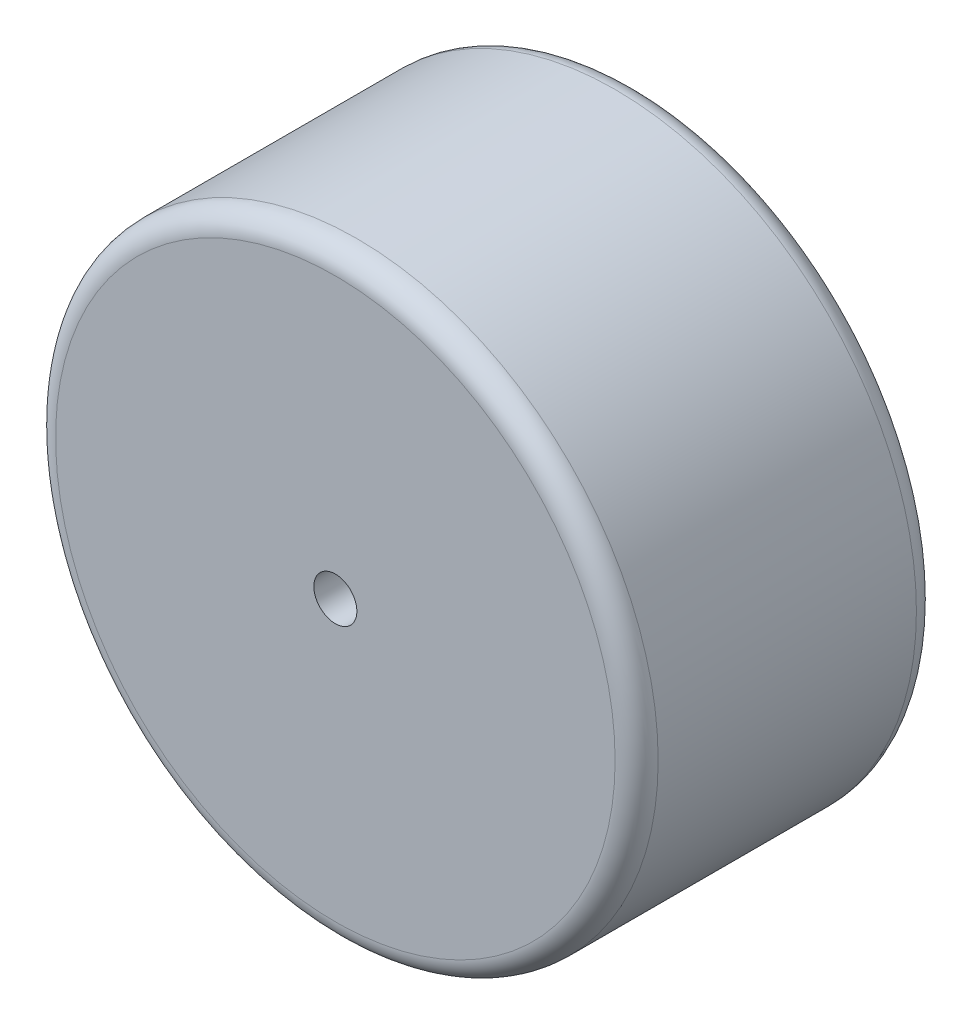
ISO-10303-21;
HEADER;
FILE_DESCRIPTION(('STEP AP214'),'2;1');
FILE_NAME('part.step','',(''),(''),'','','');
FILE_SCHEMA(('AUTOMOTIVE_DESIGN { 1 0 10303 214 1 1 1 1 }'));
ENDSEC;
DATA;
#1=APPLICATION_CONTEXT('core data for automotive mechanical design processes');
#2=APPLICATION_PROTOCOL_DEFINITION('international standard','automotive_design',2000,#1);
#3=PRODUCT_CONTEXT('',#1,'mechanical');
#4=PRODUCT('Part','Part','',(#3));
#5=PRODUCT_RELATED_PRODUCT_CATEGORY('part','',(#4));
#6=PRODUCT_DEFINITION_FORMATION('','',#4);
#7=PRODUCT_DEFINITION_CONTEXT('part definition',#1,'design');
#8=PRODUCT_DEFINITION('design','',#6,#7);
#9=PRODUCT_DEFINITION_SHAPE('','',#8);
#10=(LENGTH_UNIT() NAMED_UNIT(*) SI_UNIT(.MILLI.,.METRE.));
#11=(NAMED_UNIT(*) PLANE_ANGLE_UNIT() SI_UNIT($,.RADIAN.));
#12=(NAMED_UNIT(*) SI_UNIT($,.STERADIAN.) SOLID_ANGLE_UNIT());
#13=UNCERTAINTY_MEASURE_WITH_UNIT(LENGTH_MEASURE(1.E-05),#10,'distance_accuracy_value','');
#14=(GEOMETRIC_REPRESENTATION_CONTEXT(3) GLOBAL_UNCERTAINTY_ASSIGNED_CONTEXT((#13)) GLOBAL_UNIT_ASSIGNED_CONTEXT((#10,
#11,#12)) REPRESENTATION_CONTEXT('',''));
#15=CARTESIAN_POINT('',(0.,0.,0.));
#16=DIRECTION('',(0.,0.,1.));
#17=DIRECTION('',(1.,0.,0.));
#18=AXIS2_PLACEMENT_3D('',#15,#16,#17);
#19=CARTESIAN_POINT('',(0.,0.,88.9));
#20=DIRECTION('',(0.,0.,1.));
#21=DIRECTION('',(1.,0.,0.));
#22=AXIS2_PLACEMENT_3D('',#19,#20,#21);
#23=PLANE('',#22);
#24=CARTESIAN_POINT('',(0.,0.,88.9));
#25=DIRECTION('',(0.,0.,1.));
#26=DIRECTION('',(1.,0.,0.));
#27=AXIS2_PLACEMENT_3D('',#24,#25,#26);
#28=CIRCLE('',#27,82.55);
#29=CARTESIAN_POINT('',(82.55,0.,88.9));
#30=VERTEX_POINT('',#29);
#31=EDGE_CURVE('E10',#30,#30,#28,.T.);
#32=ORIENTED_EDGE('',*,*,#31,.T.);
#33=EDGE_LOOP('',(#32));
#34=FACE_BOUND('',#33,.T.);
#35=CARTESIAN_POINT('',(0.,0.,88.9));
#36=DIRECTION('',(0.,0.,1.));
#37=DIRECTION('',(1.,0.,0.));
#38=AXIS2_PLACEMENT_3D('',#35,#36,#37);
#39=CIRCLE('',#38,6.35);
#40=CARTESIAN_POINT('',(6.35,0.,88.9));
#41=VERTEX_POINT('',#40);
#42=EDGE_CURVE('E50',#41,#41,#39,.T.);
#43=ORIENTED_EDGE('',*,*,#42,.F.);
#44=EDGE_LOOP('',(#43));
#45=FACE_BOUND('',#44,.T.);
#46=ADVANCED_FACE('F30',(#34,#45),#23,.T.);
#47=CARTESIAN_POINT('',(0.,0.,0.));
#48=DIRECTION('',(0.,0.,1.));
#49=DIRECTION('',(1.,0.,0.));
#50=AXIS2_PLACEMENT_3D('',#47,#48,#49);
#51=PLANE('',#50);
#52=CARTESIAN_POINT('',(0.,0.,0.));
#53=DIRECTION('',(0.,0.,1.));
#54=DIRECTION('',(1.,0.,0.));
#55=AXIS2_PLACEMENT_3D('',#52,#53,#54);
#56=CIRCLE('',#55,82.55);
#57=CARTESIAN_POINT('',(82.55,0.,0.));
#58=VERTEX_POINT('',#57);
#59=EDGE_CURVE('E37',#58,#58,#56,.F.);
#60=ORIENTED_EDGE('',*,*,#59,.T.);
#61=EDGE_LOOP('',(#60));
#62=FACE_BOUND('',#61,.T.);
#63=CARTESIAN_POINT('',(0.,0.,0.));
#64=DIRECTION('',(0.,0.,1.));
#65=DIRECTION('',(1.,0.,0.));
#66=AXIS2_PLACEMENT_3D('',#63,#64,#65);
#67=CIRCLE('',#66,6.35);
#68=CARTESIAN_POINT('',(6.35,0.,0.));
#69=VERTEX_POINT('',#68);
#70=EDGE_CURVE('E51',#69,#69,#67,.T.);
#71=ORIENTED_EDGE('',*,*,#70,.T.);
#72=EDGE_LOOP('',(#71));
#73=FACE_BOUND('',#72,.T.);
#74=ADVANCED_FACE('F61',(#62,#73),#51,.F.);
#75=CARTESIAN_POINT('',(0.,0.,88.9));
#76=DIRECTION('',(0.,0.,-1.));
#77=DIRECTION('',(-1.,0.,0.));
#78=AXIS2_PLACEMENT_3D('',#75,#76,#77);
#79=CYLINDRICAL_SURFACE('',#78,88.9);
#80=CARTESIAN_POINT('',(0.,0.,6.34999999999999));
#81=DIRECTION('',(0.,0.,1.));
#82=DIRECTION('',(1.,0.,0.));
#83=AXIS2_PLACEMENT_3D('',#80,#81,#82);
#84=CIRCLE('',#83,88.9);
#85=CARTESIAN_POINT('',(88.9,0.,6.34999999999999));
#86=VERTEX_POINT('',#85);
#87=EDGE_CURVE('E41',#86,#86,#84,.T.);
#88=ORIENTED_EDGE('',*,*,#87,.T.);
#89=EDGE_LOOP('',(#88));
#90=FACE_BOUND('',#89,.T.);
#91=CARTESIAN_POINT('',(0.,0.,82.55));
#92=DIRECTION('',(0.,0.,1.));
#93=DIRECTION('',(1.,0.,0.));
#94=AXIS2_PLACEMENT_3D('',#91,#92,#93);
#95=CIRCLE('',#94,88.9);
#96=CARTESIAN_POINT('',(88.9,0.,82.55));
#97=VERTEX_POINT('',#96);
#98=EDGE_CURVE('E45',#97,#97,#95,.F.);
#99=ORIENTED_EDGE('',*,*,#98,.T.);
#100=EDGE_LOOP('',(#99));
#101=FACE_BOUND('',#100,.T.);
#102=ADVANCED_FACE('F66',(#90,#101),#79,.T.);
#103=CARTESIAN_POINT('',(0.,0.,88.9));
#104=DIRECTION('',(0.,0.,-1.));
#105=DIRECTION('',(-1.,0.,0.));
#106=AXIS2_PLACEMENT_3D('',#103,#104,#105);
#107=CYLINDRICAL_SURFACE('',#106,6.35);
#108=ORIENTED_EDGE('',*,*,#42,.T.);
#109=EDGE_LOOP('',(#108));
#110=FACE_BOUND('',#109,.T.);
#111=ORIENTED_EDGE('',*,*,#70,.F.);
#112=EDGE_LOOP('',(#111));
#113=FACE_BOUND('',#112,.T.);
#114=ADVANCED_FACE('F57',(#110,#113),#107,.F.);
#115=CARTESIAN_POINT('',(0.,0.,6.34999999999999));
#116=DIRECTION('',(0.,0.,1.));
#117=DIRECTION('',(1.,0.,0.));
#118=AXIS2_PLACEMENT_3D('',#115,#116,#117);
#119=TOROIDAL_SURFACE('',#118,82.55,6.35);
#120=ORIENTED_EDGE('',*,*,#59,.F.);
#121=EDGE_LOOP('',(#120));
#122=FACE_BOUND('',#121,.T.);
#123=ORIENTED_EDGE('',*,*,#87,.F.);
#124=EDGE_LOOP('',(#123));
#125=FACE_BOUND('',#124,.T.);
#126=ADVANCED_FACE('F72',(#122,#125),#119,.T.);
#127=CARTESIAN_POINT('',(0.,0.,82.55));
#128=DIRECTION('',(0.,0.,1.));
#129=DIRECTION('',(1.,0.,0.));
#130=AXIS2_PLACEMENT_3D('',#127,#128,#129);
#131=TOROIDAL_SURFACE('',#130,82.55,6.35);
#132=ORIENTED_EDGE('',*,*,#98,.F.);
#133=EDGE_LOOP('',(#132));
#134=FACE_BOUND('',#133,.T.);
#135=ORIENTED_EDGE('',*,*,#31,.F.);
#136=EDGE_LOOP('',(#135));
#137=FACE_BOUND('',#136,.T.);
#138=ADVANCED_FACE('F32',(#134,#137),#131,.T.);
#139=CLOSED_SHELL('',(#46,#74,#102,#114,#126,#138));
#140=MANIFOLD_SOLID_BREP('B2',#139);
#141=ADVANCED_BREP_SHAPE_REPRESENTATION('',(#18,#140),#14);
#142=SHAPE_DEFINITION_REPRESENTATION(#9,#141);
ENDSEC;
END-ISO-10303-21;
